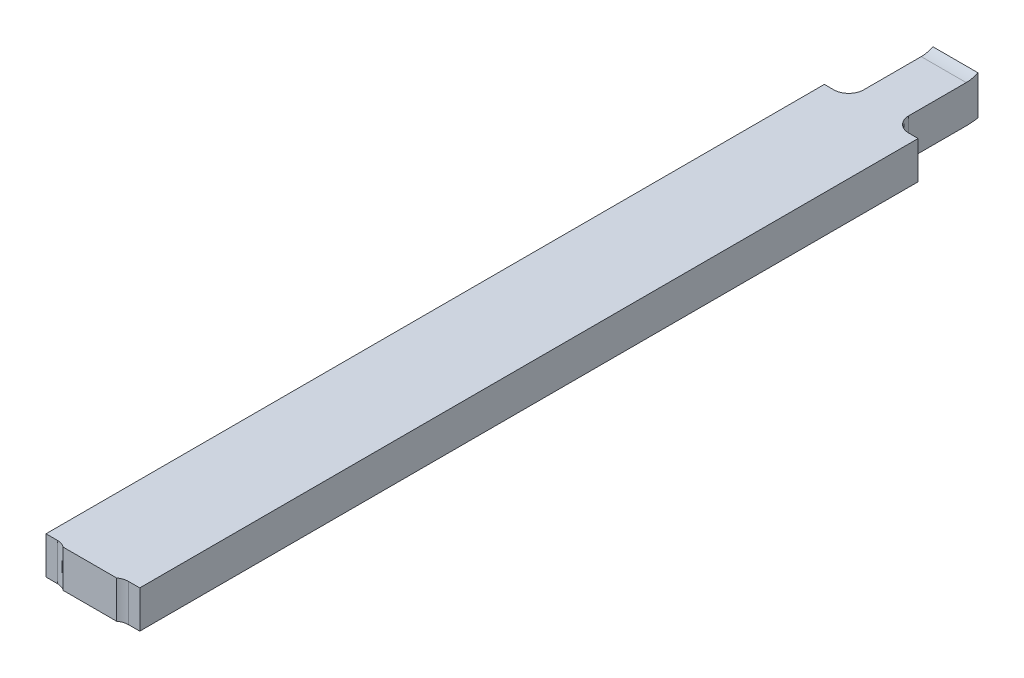
ISO-10303-21;
HEADER;
FILE_DESCRIPTION(('STEP AP214'),'2;1');
FILE_NAME('part.step','',(''),(''),'','','');
FILE_SCHEMA(('AUTOMOTIVE_DESIGN { 1 0 10303 214 1 1 1 1 }'));
ENDSEC;
DATA;
#1=APPLICATION_CONTEXT('core data for automotive mechanical design processes');
#2=APPLICATION_PROTOCOL_DEFINITION('international standard','automotive_design',2000,#1);
#3=PRODUCT_CONTEXT('',#1,'mechanical');
#4=PRODUCT('Part','Part','',(#3));
#5=PRODUCT_RELATED_PRODUCT_CATEGORY('part','',(#4));
#6=PRODUCT_DEFINITION_FORMATION('','',#4);
#7=PRODUCT_DEFINITION_CONTEXT('part definition',#1,'design');
#8=PRODUCT_DEFINITION('design','',#6,#7);
#9=PRODUCT_DEFINITION_SHAPE('','',#8);
#10=(LENGTH_UNIT() NAMED_UNIT(*) SI_UNIT(.MILLI.,.METRE.));
#11=(NAMED_UNIT(*) PLANE_ANGLE_UNIT() SI_UNIT($,.RADIAN.));
#12=(NAMED_UNIT(*) SI_UNIT($,.STERADIAN.) SOLID_ANGLE_UNIT());
#13=UNCERTAINTY_MEASURE_WITH_UNIT(LENGTH_MEASURE(1.E-05),#10,'distance_accuracy_value','');
#14=(GEOMETRIC_REPRESENTATION_CONTEXT(3) GLOBAL_UNCERTAINTY_ASSIGNED_CONTEXT((#13)) GLOBAL_UNIT_ASSIGNED_CONTEXT((#10,
#11,#12)) REPRESENTATION_CONTEXT('',''));
#15=CARTESIAN_POINT('',(0.,0.,0.));
#16=DIRECTION('',(0.,0.,1.));
#17=DIRECTION('',(1.,0.,0.));
#18=AXIS2_PLACEMENT_3D('',#15,#16,#17);
#19=CARTESIAN_POINT('',(4.,-0.3652289464185,-7.500488855463));
#20=DIRECTION('',(0.,0.,1.));
#21=DIRECTION('',(1.,0.,0.));
#22=AXIS2_PLACEMENT_3D('',#19,#20,#21);
#23=PLANE('',#22);
#24=DIRECTION('',(0.,1.,0.));
#25=VECTOR('',#24,1.);
#26=CARTESIAN_POINT('',(4.12,-0.3694122088881,-7.500488855463));
#27=LINE('',#26,#25);
#28=CARTESIAN_POINT('',(4.12,-0.469296338681694,-7.50048885546298));
#29=VERTEX_POINT('',#28);
#30=CARTESIAN_POINT('',(4.12,-0.261161554155171,-7.50048885546301));
#31=VERTEX_POINT('',#30);
#32=EDGE_CURVE('E150',#29,#31,#27,.T.);
#33=ORIENTED_EDGE('',*,*,#32,.F.);
#34=DIRECTION('',(-1.,0.,0.));
#35=VECTOR('',#34,1.);
#36=CARTESIAN_POINT('',(4.125727283719,-0.469296338681697,-7.50048885546296));
#37=LINE('',#36,#35);
#38=CARTESIAN_POINT('',(3.88,-0.469296338681694,-7.50048885546298));
#39=VERTEX_POINT('',#38);
#40=EDGE_CURVE('E139',#39,#29,#37,.F.);
#41=ORIENTED_EDGE('',*,*,#40,.F.);
#42=DIRECTION('',(0.,1.,0.));
#43=VECTOR('',#42,1.);
#44=CARTESIAN_POINT('',(3.88,-0.3694122088881,-7.500488855463));
#45=LINE('',#44,#43);
#46=CARTESIAN_POINT('',(3.88,-0.261161554155171,-7.50048885546301));
#47=VERTEX_POINT('',#46);
#48=EDGE_CURVE('E535',#39,#47,#45,.T.);
#49=ORIENTED_EDGE('',*,*,#48,.T.);
#50=DIRECTION('',(1.,0.,0.));
#51=VECTOR('',#50,1.);
#52=CARTESIAN_POINT('',(3.874272716281,-0.261161554155164,-7.50048885546303));
#53=LINE('',#52,#51);
#54=EDGE_CURVE('E147',#47,#31,#53,.T.);
#55=ORIENTED_EDGE('',*,*,#54,.T.);
#56=EDGE_LOOP('',(#33,#41,#49,#55));
#57=FACE_BOUND('',#56,.T.);
#58=ADVANCED_FACE('F17',(#57),#23,.F.);
#59=CARTESIAN_POINT('',(4.125727283719,-0.125,-7.43756007691));
#60=DIRECTION('',(-1.,0.,0.));
#61=DIRECTION('',(0.,0.,1.));
#62=AXIS2_PLACEMENT_3D('',#59,#60,#61);
#63=CYLINDRICAL_SURFACE('',#62,0.3499999999997);
#64=CARTESIAN_POINT('',(3.88,-0.125,-7.43756007691));
#65=DIRECTION('',(-1.,0.,0.));
#66=DIRECTION('',(0.,0.,1.));
#67=AXIS2_PLACEMENT_3D('',#64,#65,#66);
#68=CIRCLE('',#67,0.3499999999997);
#69=CARTESIAN_POINT('',(3.88,-0.475,-7.43756007691));
#70=VERTEX_POINT('',#69);
#71=EDGE_CURVE('E250',#70,#39,#68,.F.);
#72=ORIENTED_EDGE('',*,*,#71,.T.);
#73=ORIENTED_EDGE('',*,*,#40,.T.);
#74=CARTESIAN_POINT('',(4.12,-0.125,-7.43756007691));
#75=DIRECTION('',(-1.,0.,0.));
#76=DIRECTION('',(0.,0.,1.));
#77=AXIS2_PLACEMENT_3D('',#74,#75,#76);
#78=CIRCLE('',#77,0.3499999999997);
#79=CARTESIAN_POINT('',(4.12,-0.475,-7.43756007691));
#80=VERTEX_POINT('',#79);
#81=EDGE_CURVE('E274',#80,#29,#78,.F.);
#82=ORIENTED_EDGE('',*,*,#81,.F.);
#83=DIRECTION('',(1.,0.,0.));
#84=VECTOR('',#83,1.);
#85=CARTESIAN_POINT('',(4.,-0.475,-7.43756007691));
#86=LINE('',#85,#84);
#87=EDGE_CURVE('E138',#80,#70,#86,.F.);
#88=ORIENTED_EDGE('',*,*,#87,.T.);
#89=EDGE_LOOP('',(#72,#73,#82,#88));
#90=FACE_BOUND('',#89,.T.);
#91=ADVANCED_FACE('F255',(#90),#63,.T.);
#92=CARTESIAN_POINT('',(4.,-0.475,-5.160844573418));
#93=DIRECTION('',(0.,1.,0.));
#94=DIRECTION('',(0.,0.,1.));
#95=AXIS2_PLACEMENT_3D('',#92,#93,#94);
#96=PLANE('',#95);
#97=DIRECTION('',(1.,0.,0.));
#98=VECTOR('',#97,1.);
#99=CARTESIAN_POINT('',(4.,-0.475,-2.9));
#100=LINE('',#99,#98);
#101=CARTESIAN_POINT('',(3.75,-0.475,-2.9));
#102=VERTEX_POINT('',#101);
#103=CARTESIAN_POINT('',(3.81,-0.475,-2.89999999999976));
#104=VERTEX_POINT('',#103);
#105=EDGE_CURVE('E118',#102,#104,#100,.T.);
#106=ORIENTED_EDGE('',*,*,#105,.F.);
#107=DIRECTION('',(0.,0.,-1.));
#108=VECTOR('',#107,1.);
#109=CARTESIAN_POINT('',(3.75,-0.475,-4.975579331992));
#110=LINE('',#109,#108);
#111=CARTESIAN_POINT('',(3.75,-0.475,-7.051158663985));
#112=VERTEX_POINT('',#111);
#113=EDGE_CURVE('E213',#102,#112,#110,.T.);
#114=ORIENTED_EDGE('',*,*,#113,.T.);
#115=DIRECTION('',(1.,0.,0.));
#116=VECTOR('',#115,1.);
#117=CARTESIAN_POINT('',(3.775,-0.475,-7.051158663985));
#118=LINE('',#117,#116);
#119=CARTESIAN_POINT('',(3.8,-0.475,-7.05115866398505));
#120=VERTEX_POINT('',#119);
#121=EDGE_CURVE('E218',#112,#120,#118,.T.);
#122=ORIENTED_EDGE('',*,*,#121,.T.);
#123=CARTESIAN_POINT('',(3.88000000000032,-0.475,-7.131158663985));
#124=CARTESIAN_POINT('',(3.87999112440513,-0.475,-7.12663228539964));
#125=CARTESIAN_POINT('',(3.87960496952686,-0.475,-7.12211245444064));
#126=CARTESIAN_POINT('',(3.87808437325866,-0.475,-7.11320506981295));
#127=CARTESIAN_POINT('',(3.87695060689905,-0.475,-7.10881740054697));
#128=CARTESIAN_POINT('',(3.87244381446599,-0.475,-7.09604021502532));
#129=CARTESIAN_POINT('',(3.8679651813496,-0.475,-7.08801257629077));
#130=CARTESIAN_POINT('',(3.85665881135734,-0.475,-7.07397145931292));
#131=CARTESIAN_POINT('',(3.84985092513137,-0.475,-7.06794178198466));
#132=CARTESIAN_POINT('',(3.83457018431966,-0.475,-7.05845747919415));
#133=CARTESIAN_POINT('',(3.82608908375479,-0.475,-7.05501603051907));
#134=CARTESIAN_POINT('',(3.81161549132932,-0.475,-7.05178938735803));
#135=CARTESIAN_POINT('',(3.80580339960844,-0.475,-7.05114165155808));
#136=CARTESIAN_POINT('',(3.8,-0.475,-7.05115866398511));
#137=B_SPLINE_CURVE_WITH_KNOTS('',3,(#123,#124,#125,#126,#127,#128,#129,#130,#131,#132,#133,
#134,#135,#136),.UNSPECIFIED.,.F.,.F.,(4,2,2,2,2,2,4),(0.,0.0135512792184638,0.0270903394942115,
0.0541002294468885,0.0808854407469148,0.107806110463959,0.125207976056705),.UNSPECIFIED.);
#138=CARTESIAN_POINT('',(3.88000000000016,-0.475,-7.131158663985));
#139=VERTEX_POINT('',#138);
#140=EDGE_CURVE('E239',#139,#120,#137,.T.);
#141=ORIENTED_EDGE('',*,*,#140,.F.);
#142=DIRECTION('',(0.,0.,-1.));
#143=VECTOR('',#142,1.);
#144=CARTESIAN_POINT('',(3.88,-0.475,-7.317732357319));
#145=LINE('',#144,#143);
#146=EDGE_CURVE('E537',#139,#70,#145,.T.);
#147=ORIENTED_EDGE('',*,*,#146,.T.);
#148=ORIENTED_EDGE('',*,*,#87,.F.);
#149=DIRECTION('',(0.,0.,-1.));
#150=VECTOR('',#149,1.);
#151=CARTESIAN_POINT('',(4.12,-0.475,-7.317732357319));
#152=LINE('',#151,#150);
#153=CARTESIAN_POINT('',(4.12000000000005,-0.475,-7.131158663985));
#154=VERTEX_POINT('',#153);
#155=EDGE_CURVE('E533',#154,#80,#152,.T.);
#156=ORIENTED_EDGE('',*,*,#155,.F.);
#157=CARTESIAN_POINT('',(4.2,-0.475,-7.05115866398468));
#158=CARTESIAN_POINT('',(4.19547362141464,-0.475,-7.05116753957987));
#159=CARTESIAN_POINT('',(4.19095379045563,-0.475,-7.05155369445814));
#160=CARTESIAN_POINT('',(4.18204640582792,-0.475,-7.05307429072635));
#161=CARTESIAN_POINT('',(4.17765873656194,-0.475,-7.05420805708595));
#162=CARTESIAN_POINT('',(4.16488155104028,-0.475,-7.05871484951903));
#163=CARTESIAN_POINT('',(4.15685391230571,-0.475,-7.06319348263544));
#164=CARTESIAN_POINT('',(4.14281279532786,-0.475,-7.07449985262772));
#165=CARTESIAN_POINT('',(4.13678311799962,-0.475,-7.08130773885369));
#166=CARTESIAN_POINT('',(4.12729881520911,-0.475,-7.09658847966541));
#167=CARTESIAN_POINT('',(4.12385736653404,-0.475,-7.10506958023029));
#168=CARTESIAN_POINT('',(4.12063072337302,-0.475,-7.11954317265574));
#169=CARTESIAN_POINT('',(4.11998298757308,-0.475,-7.12535526437659));
#170=CARTESIAN_POINT('',(4.12000000000011,-0.475,-7.131158663985));
#171=B_SPLINE_CURVE_WITH_KNOTS('',3,(#157,#158,#159,#160,#161,#162,#163,#164,#165,#166,#167,
#168,#169,#170),.UNSPECIFIED.,.F.,.F.,(4,2,2,2,2,2,4),(0.,0.0135512792184821,0.0270903394942493,
0.0541002294469664,0.0808854407469868,0.107806110464046,0.125207976056707),.UNSPECIFIED.);
#172=CARTESIAN_POINT('',(4.2,-0.475,-7.05115866398484));
#173=VERTEX_POINT('',#172);
#174=EDGE_CURVE('E266',#173,#154,#171,.T.);
#175=ORIENTED_EDGE('',*,*,#174,.F.);
#176=DIRECTION('',(1.,0.,0.));
#177=VECTOR('',#176,1.);
#178=CARTESIAN_POINT('',(4.225,-0.475,-7.051158663985));
#179=LINE('',#178,#177);
#180=CARTESIAN_POINT('',(4.25,-0.475,-7.051158663985));
#181=VERTEX_POINT('',#180);
#182=EDGE_CURVE('E151',#173,#181,#179,.T.);
#183=ORIENTED_EDGE('',*,*,#182,.T.);
#184=DIRECTION('',(0.,0.,-1.));
#185=VECTOR('',#184,1.);
#186=CARTESIAN_POINT('',(4.25,-0.475,-4.975579331992));
#187=LINE('',#186,#185);
#188=CARTESIAN_POINT('',(4.25,-0.475,-2.9));
#189=VERTEX_POINT('',#188);
#190=EDGE_CURVE('E155',#189,#181,#187,.T.);
#191=ORIENTED_EDGE('',*,*,#190,.F.);
#192=DIRECTION('',(1.,0.,0.));
#193=VECTOR('',#192,1.);
#194=CARTESIAN_POINT('',(4.22,-0.475,-2.9));
#195=LINE('',#194,#193);
#196=CARTESIAN_POINT('',(4.19,-0.475,-2.89999999999989));
#197=VERTEX_POINT('',#196);
#198=EDGE_CURVE('E163',#197,#189,#195,.T.);
#199=ORIENTED_EDGE('',*,*,#198,.F.);
#200=CARTESIAN_POINT('',(4.14217544757885,-0.475,-2.8841290699251));
#201=CARTESIAN_POINT('',(4.14622022070471,-0.475,-2.88715347788678));
#202=CARTESIAN_POINT('',(4.1505544258207,-0.475,-2.88978498732686));
#203=CARTESIAN_POINT('',(4.15913369497632,-0.475,-2.8939430866676));
#204=CARTESIAN_POINT('',(4.16333518410899,-0.475,-2.89555994023161));
#205=CARTESIAN_POINT('',(4.17194880942199,-0.475,-2.89806057790455));
#206=CARTESIAN_POINT('',(4.17636081104944,-0.475,-2.89894482380699));
#207=CARTESIAN_POINT('',(4.18386363483119,-0.475,-2.89981357444961));
#208=CARTESIAN_POINT('',(4.18693284156798,-0.475,-2.89999375978714));
#209=CARTESIAN_POINT('',(4.19,-0.475,-2.89999999999978));
#210=B_SPLINE_CURVE_WITH_KNOTS('',3,(#200,#201,#202,#203,#204,#205,#206,#207,#208,#209),
.UNSPECIFIED.,.F.,.F.,(4,2,2,2,4),(0.,0.0151223248428411,0.0285648972663083,0.0419989898086751,
0.0512012871013987),.UNSPECIFIED.);
#211=CARTESIAN_POINT('',(4.14217544757892,-0.475,-2.88412906992505));
#212=VERTEX_POINT('',#211);
#213=EDGE_CURVE('E125',#212,#197,#210,.T.);
#214=ORIENTED_EDGE('',*,*,#213,.F.);
#215=DIRECTION('',(1.,0.,0.));
#216=VECTOR('',#215,1.);
#217=CARTESIAN_POINT('',(4.,-0.475,-2.884129069925));
#218=LINE('',#217,#216);
#219=CARTESIAN_POINT('',(3.85782456637205,-0.475,-2.88412906992502));
#220=VERTEX_POINT('',#219);
#221=EDGE_CURVE('E129',#220,#212,#218,.T.);
#222=ORIENTED_EDGE('',*,*,#221,.F.);
#223=CARTESIAN_POINT('',(3.81,-0.475,-2.89999999999952));
#224=CARTESIAN_POINT('',(3.81503269638164,-0.475,-2.90001482409384));
#225=CARTESIAN_POINT('',(3.82008184216692,-0.475,-2.89952557596737));
#226=CARTESIAN_POINT('',(3.83385228395106,-0.475,-2.89686256447201));
#227=CARTESIAN_POINT('',(3.84239947608123,-0.475,-2.89367998586962));
#228=CARTESIAN_POINT('',(3.85280786570126,-0.475,-2.88765952253235));
#229=CARTESIAN_POINT('',(3.85537440128387,-0.475,-2.88596721904186));
#230=CARTESIAN_POINT('',(3.8578245663721,-0.475,-2.88412906992503));
#231=B_SPLINE_CURVE_WITH_KNOTS('',3,(#223,#224,#225,#226,#227,#228,#229,#230),.UNSPECIFIED.,.F.,
.F.,(4,2,2,4),(0.,0.0151178951010511,0.0419060489799024,0.0511063402020691),.UNSPECIFIED.);
#232=EDGE_CURVE('E20',#104,#220,#231,.T.);
#233=ORIENTED_EDGE('',*,*,#232,.F.);
#234=EDGE_LOOP('',(#106,#114,#122,#141,#147,#148,#156,#175,#183,#191,#199,#214,#222,#233));
#235=FACE_BOUND('',#234,.T.);
#236=ADVANCED_FACE('F135',(#235),#96,.F.);
#237=CARTESIAN_POINT('',(4.192867608479,-0.269272716281,-2.899957930186));
#238=CARTESIAN_POINT('',(4.191912675517,-0.269272716281,-2.899988554812));
#239=CARTESIAN_POINT('',(4.185731487658,-0.269272716281,-2.900079343105));
#240=CARTESIAN_POINT('',(4.174291413689,-0.269272716281,-2.898963559635));
#241=CARTESIAN_POINT('',(4.159190917084,-0.269272716281,-2.894390814224));
#242=CARTESIAN_POINT('',(4.1486873263,-0.269272716281,-2.888776760997));
#243=CARTESIAN_POINT('',(4.141721023167,-0.269272716281,-2.883851645707));
#244=CARTESIAN_POINT('',(4.139152051861,-0.269272716281,-2.881786274905));
#245=CARTESIAN_POINT('',(4.137705478113,-0.269272716281,-2.880535760884));
#246=(BOUNDED_CURVE() B_SPLINE_CURVE(3,(#237,#238,#239,#240,#241,#242,#243,#244,#245),
.UNSPECIFIED.,.F.,.F.) B_SPLINE_CURVE_WITH_KNOTS((4,1,1,1,1,1,4),(0.,0.0480076126077,
0.3103664664067,0.5726487803877,0.8349383013298,0.9041878403074,1.),
.UNSPECIFIED.) CURVE() GEOMETRIC_REPRESENTATION_ITEM() RATIONAL_B_SPLINE_CURVE((1.,1.,1.,1.,1.,
1.,1.,1.,1.)) REPRESENTATION_ITEM(''));
#247=DIRECTION('',(0.,-1.,0.));
#248=VECTOR('',#247,1.);
#249=SURFACE_OF_LINEAR_EXTRUSION('',#246,#248);
#250=CARTESIAN_POINT('',(4.14217544464746,-0.275,-2.88412906773656));
#251=CARTESIAN_POINT('',(4.14622021763433,-0.275,-2.88715347588347));
#252=CARTESIAN_POINT('',(4.15055442262976,-0.275,-2.88978498552233));
#253=CARTESIAN_POINT('',(4.15913369159402,-0.275,-2.89394308525624));
#254=CARTESIAN_POINT('',(4.16333518065168,-0.275,-2.89555993901277));
#255=CARTESIAN_POINT('',(4.17194880584974,-0.275,-2.89806057708111));
#256=CARTESIAN_POINT('',(4.17636080743733,-0.275,-2.89894482318606));
#257=CARTESIAN_POINT('',(4.18386363239327,-0.275,-2.89981357430863));
#258=CARTESIAN_POINT('',(4.18693284034916,-0.275,-2.89999375978684));
#259=CARTESIAN_POINT('',(4.19,-0.275,-2.89999999999978));
#260=B_SPLINE_CURVE_WITH_KNOTS('',3,(#250,#251,#252,#253,#254,#255,#256,#257,#258,#259),
.UNSPECIFIED.,.F.,.F.,(4,2,2,2,4),(0.,0.015122324842671,0.0285648972632462,0.041998989809666,
0.0512012907536541),.UNSPECIFIED.);
#261=CARTESIAN_POINT('',(4.14217544611323,-0.275,-2.88412906883078));
#262=VERTEX_POINT('',#261);
#263=CARTESIAN_POINT('',(4.19,-0.275,-2.9));
#264=VERTEX_POINT('',#263);
#265=EDGE_CURVE('E132',#262,#264,#260,.T.);
#266=ORIENTED_EDGE('',*,*,#265,.F.);
#267=DIRECTION('',(0.,1.,0.));
#268=VECTOR('',#267,1.);
#269=CARTESIAN_POINT('',(4.142175447579,-0.375,-2.884129069925));
#270=LINE('',#269,#268);
#271=EDGE_CURVE('E133',#212,#262,#270,.T.);
#272=ORIENTED_EDGE('',*,*,#271,.F.);
#273=ORIENTED_EDGE('',*,*,#213,.T.);
#274=DIRECTION('',(0.,1.,0.));
#275=VECTOR('',#274,1.);
#276=CARTESIAN_POINT('',(4.19,-0.375,-2.9));
#277=LINE('',#276,#275);
#278=EDGE_CURVE('E166',#264,#197,#277,.F.);
#279=ORIENTED_EDGE('',*,*,#278,.F.);
#280=EDGE_LOOP('',(#266,#272,#273,#279));
#281=FACE_BOUND('',#280,.T.);
#282=ADVANCED_FACE('F254',(#281),#249,.T.);
#283=CARTESIAN_POINT('',(4.22,-0.375,-2.9));
#284=DIRECTION('',(0.,0.,1.));
#285=DIRECTION('',(1.,0.,0.));
#286=AXIS2_PLACEMENT_3D('',#283,#284,#285);
#287=PLANE('',#286);
#288=DIRECTION('',(0.,1.,0.));
#289=VECTOR('',#288,1.);
#290=CARTESIAN_POINT('',(4.25,-0.375,-2.9));
#291=LINE('',#290,#289);
#292=CARTESIAN_POINT('',(4.25,-0.275,-2.9));
#293=VERTEX_POINT('',#292);
#294=EDGE_CURVE('E160',#293,#189,#291,.F.);
#295=ORIENTED_EDGE('',*,*,#294,.F.);
#296=DIRECTION('',(1.,0.,0.));
#297=VECTOR('',#296,1.);
#298=CARTESIAN_POINT('',(4.,-0.275,-2.9));
#299=LINE('',#298,#297);
#300=EDGE_CURVE('E306',#264,#293,#299,.T.);
#301=ORIENTED_EDGE('',*,*,#300,.F.);
#302=ORIENTED_EDGE('',*,*,#278,.T.);
#303=ORIENTED_EDGE('',*,*,#198,.T.);
#304=EDGE_LOOP('',(#295,#301,#302,#303));
#305=FACE_BOUND('',#304,.T.);
#306=ADVANCED_FACE('F368',(#305),#287,.T.);
#307=CARTESIAN_POINT('',(4.25,-0.375,-4.975579331992));
#308=DIRECTION('',(1.,0.,0.));
#309=DIRECTION('',(0.,0.,-1.));
#310=AXIS2_PLACEMENT_3D('',#307,#308,#309);
#311=PLANE('',#310);
#312=DIRECTION('',(0.,1.,0.));
#313=VECTOR('',#312,1.);
#314=CARTESIAN_POINT('',(4.25,-0.375,-7.051158663985));
#315=LINE('',#314,#313);
#316=CARTESIAN_POINT('',(4.25,-0.275,-7.051158663985));
#317=VERTEX_POINT('',#316);
#318=EDGE_CURVE('E154',#181,#317,#315,.T.);
#319=ORIENTED_EDGE('',*,*,#318,.T.);
#320=DIRECTION('',(0.,0.,1.));
#321=VECTOR('',#320,1.);
#322=CARTESIAN_POINT('',(4.25,-0.275,-5.160844573418));
#323=LINE('',#322,#321);
#324=EDGE_CURVE('E302',#293,#317,#323,.F.);
#325=ORIENTED_EDGE('',*,*,#324,.F.);
#326=ORIENTED_EDGE('',*,*,#294,.T.);
#327=ORIENTED_EDGE('',*,*,#190,.T.);
#328=EDGE_LOOP('',(#319,#325,#326,#327));
#329=FACE_BOUND('',#328,.T.);
#330=ADVANCED_FACE('F373',(#329),#311,.T.);
#331=CARTESIAN_POINT('',(4.225,-0.375,-7.051158663985));
#332=DIRECTION('',(0.,0.,1.));
#333=DIRECTION('',(1.,0.,0.));
#334=AXIS2_PLACEMENT_3D('',#331,#332,#333);
#335=PLANE('',#334);
#336=ORIENTED_EDGE('',*,*,#182,.F.);
#337=DIRECTION('',(0.,-1.,0.));
#338=VECTOR('',#337,1.);
#339=CARTESIAN_POINT('',(4.2,-0.269272716281,-7.05115866398468));
#340=LINE('',#339,#338);
#341=CARTESIAN_POINT('',(4.2,-0.275,-7.05115866398476));
#342=VERTEX_POINT('',#341);
#343=EDGE_CURVE('E273',#342,#173,#340,.T.);
#344=ORIENTED_EDGE('',*,*,#343,.F.);
#345=DIRECTION('',(1.,0.,0.));
#346=VECTOR('',#345,1.);
#347=CARTESIAN_POINT('',(4.,-0.275,-7.051158663985));
#348=LINE('',#347,#346);
#349=EDGE_CURVE('E305',#317,#342,#348,.F.);
#350=ORIENTED_EDGE('',*,*,#349,.F.);
#351=ORIENTED_EDGE('',*,*,#318,.F.);
#352=EDGE_LOOP('',(#336,#344,#350,#351));
#353=FACE_BOUND('',#352,.T.);
#354=ADVANCED_FACE('F283',(#353),#335,.F.);
#355=CARTESIAN_POINT('',(4.120042070413,-0.269272716281,-7.134026291144));
#356=CARTESIAN_POINT('',(4.120011445371,-0.269272716281,-7.133071351971));
#357=CARTESIAN_POINT('',(4.119920656285,-0.269272716281,-7.126890157897));
#358=CARTESIAN_POINT('',(4.121036440365,-0.269272716281,-7.115450077674));
#359=CARTESIAN_POINT('',(4.125609185776,-0.269272716281,-7.100349581069));
#360=CARTESIAN_POINT('',(4.133048947975,-0.269272716281,-7.086430187272));
#361=CARTESIAN_POINT('',(4.143068695624,-0.269272716281,-7.074236320435));
#362=CARTESIAN_POINT('',(4.155262096496,-0.269272716281,-7.064213675467));
#363=CARTESIAN_POINT('',(4.169183798376,-0.269272716281,-7.056770327068));
#364=CARTESIAN_POINT('',(4.184287959508,-0.269272716281,-7.05219575577));
#365=CARTESIAN_POINT('',(4.195729514596,-0.269272716281,-7.051079350384));
#366=CARTESIAN_POINT('',(4.201910679261,-0.269272716281,-7.051170096432));
#367=CARTESIAN_POINT('',(4.202864618741,-0.269272716281,-7.0512006723));
#368=(BOUNDED_CURVE() B_SPLINE_CURVE(3,(#355,#356,#357,#358,#359,#360,#361,#362,#363,#364,#365,
#366,#367),.UNSPECIFIED.,.F.,.F.) B_SPLINE_CURVE_WITH_KNOTS((4,1,1,1,1,1,1,1,1,1,4),(0.,
0.02187366901522,0.1414112381412,0.260913933719,0.380419912977,0.4999590271853,0.6195124003892,
0.7390518477007,0.8585895788734,0.9781493142558,1.),
.UNSPECIFIED.) CURVE() GEOMETRIC_REPRESENTATION_ITEM() RATIONAL_B_SPLINE_CURVE((1.,1.,1.,1.,1.,
1.,1.,1.,1.,1.,1.,1.,1.)) REPRESENTATION_ITEM(''));
#369=DIRECTION('',(0.,-1.,0.));
#370=VECTOR('',#369,1.);
#371=SURFACE_OF_LINEAR_EXTRUSION('',#368,#370);
#372=DIRECTION('',(0.,1.,0.));
#373=VECTOR('',#372,1.);
#374=CARTESIAN_POINT('',(4.12,-0.3694122088881,-7.131158663985));
#375=LINE('',#374,#373);
#376=CARTESIAN_POINT('',(4.12,-0.275,-7.131158663985));
#377=VERTEX_POINT('',#376);
#378=EDGE_CURVE('E272',#377,#154,#375,.F.);
#379=ORIENTED_EDGE('',*,*,#378,.F.);
#380=CARTESIAN_POINT('',(4.2,-0.275,-7.05115866398468));
#381=CARTESIAN_POINT('',(4.19547362141464,-0.275,-7.05116753957987));
#382=CARTESIAN_POINT('',(4.19095379045563,-0.275,-7.05155369445814));
#383=CARTESIAN_POINT('',(4.18204640582792,-0.275,-7.05307429072635));
#384=CARTESIAN_POINT('',(4.17765873656194,-0.275,-7.05420805708595));
#385=CARTESIAN_POINT('',(4.16488155104028,-0.275,-7.05871484951903));
#386=CARTESIAN_POINT('',(4.15685391230571,-0.275,-7.06319348263544));
#387=CARTESIAN_POINT('',(4.14281279532786,-0.275,-7.07449985262772));
#388=CARTESIAN_POINT('',(4.13678311799962,-0.275,-7.08130773885369));
#389=CARTESIAN_POINT('',(4.12729881520911,-0.275,-7.09658847966541));
#390=CARTESIAN_POINT('',(4.12385736653404,-0.275,-7.10506958023029));
#391=CARTESIAN_POINT('',(4.12063072337302,-0.275,-7.11954317265574));
#392=CARTESIAN_POINT('',(4.11998298757308,-0.275,-7.12535526437659));
#393=CARTESIAN_POINT('',(4.12000000000011,-0.275,-7.131158663985));
#394=B_SPLINE_CURVE_WITH_KNOTS('',3,(#380,#381,#382,#383,#384,#385,#386,#387,#388,#389,#390,
#391,#392,#393),.UNSPECIFIED.,.F.,.F.,(4,2,2,2,2,2,4),(0.,0.0135512792184821,0.0270903394942493,
0.0541002294469664,0.0808854407469868,0.107806110464046,0.125207976056707),.UNSPECIFIED.);
#395=EDGE_CURVE('E355',#342,#377,#394,.T.);
#396=ORIENTED_EDGE('',*,*,#395,.F.);
#397=ORIENTED_EDGE('',*,*,#343,.T.);
#398=ORIENTED_EDGE('',*,*,#174,.T.);
#399=EDGE_LOOP('',(#379,#396,#397,#398));
#400=FACE_BOUND('',#399,.T.);
#401=ADVANCED_FACE('F276',(#400),#371,.T.);
#402=CARTESIAN_POINT('',(4.12,-0.3694122088881,-7.317732357319));
#403=DIRECTION('',(1.,0.,0.));
#404=DIRECTION('',(0.,0.,-1.));
#405=AXIS2_PLACEMENT_3D('',#402,#403,#404);
#406=PLANE('',#405);
#407=ORIENTED_EDGE('',*,*,#81,.T.);
#408=ORIENTED_EDGE('',*,*,#32,.T.);
#409=CARTESIAN_POINT('',(4.12,-0.125,-7.437560076911));
#410=DIRECTION('',(1.,0.,0.));
#411=DIRECTION('',(0.,0.,-1.));
#412=AXIS2_PLACEMENT_3D('',#409,#410,#411);
#413=CIRCLE('',#412,0.15);
#414=CARTESIAN_POINT('',(4.12,-0.275,-7.437560076911));
#415=VERTEX_POINT('',#414);
#416=EDGE_CURVE('E149',#31,#415,#413,.F.);
#417=ORIENTED_EDGE('',*,*,#416,.T.);
#418=DIRECTION('',(0.,0.,1.));
#419=VECTOR('',#418,1.);
#420=CARTESIAN_POINT('',(4.12,-0.275,-5.160844573418));
#421=LINE('',#420,#419);
#422=EDGE_CURVE('E348',#377,#415,#421,.F.);
#423=ORIENTED_EDGE('',*,*,#422,.F.);
#424=ORIENTED_EDGE('',*,*,#378,.T.);
#425=ORIENTED_EDGE('',*,*,#155,.T.);
#426=EDGE_LOOP('',(#407,#408,#417,#423,#424,#425));
#427=FACE_BOUND('',#426,.T.);
#428=ADVANCED_FACE('F282',(#427),#406,.T.);
#429=CARTESIAN_POINT('',(3.874272716281,-0.125,-7.437560076911));
#430=DIRECTION('',(1.,0.,0.));
#431=DIRECTION('',(0.,0.,-1.));
#432=AXIS2_PLACEMENT_3D('',#429,#430,#431);
#433=CYLINDRICAL_SURFACE('',#432,0.15);
#434=DIRECTION('',(1.,0.,0.));
#435=VECTOR('',#434,1.);
#436=CARTESIAN_POINT('',(4.,-0.275,-7.437560076911));
#437=LINE('',#436,#435);
#438=CARTESIAN_POINT('',(3.88,-0.275,-7.437560076911));
#439=VERTEX_POINT('',#438);
#440=EDGE_CURVE('E346',#415,#439,#437,.F.);
#441=ORIENTED_EDGE('',*,*,#440,.F.);
#442=ORIENTED_EDGE('',*,*,#416,.F.);
#443=ORIENTED_EDGE('',*,*,#54,.F.);
#444=CARTESIAN_POINT('',(3.88,-0.125,-7.437560076911));
#445=DIRECTION('',(1.,0.,0.));
#446=DIRECTION('',(0.,0.,-1.));
#447=AXIS2_PLACEMENT_3D('',#444,#445,#446);
#448=CIRCLE('',#447,0.15);
#449=EDGE_CURVE('E536',#47,#439,#448,.F.);
#450=ORIENTED_EDGE('',*,*,#449,.T.);
#451=EDGE_LOOP('',(#441,#442,#443,#450));
#452=FACE_BOUND('',#451,.T.);
#453=ADVANCED_FACE('F443',(#452),#433,.F.);
#454=CARTESIAN_POINT('',(3.88,-0.3694122088881,-7.317732357319));
#455=DIRECTION('',(1.,0.,0.));
#456=DIRECTION('',(0.,0.,-1.));
#457=AXIS2_PLACEMENT_3D('',#454,#455,#456);
#458=PLANE('',#457);
#459=ORIENTED_EDGE('',*,*,#146,.F.);
#460=DIRECTION('',(0.,-1.,0.));
#461=VECTOR('',#460,1.);
#462=CARTESIAN_POINT('',(3.88000000000032,-0.269272716281,-7.131158663985));
#463=LINE('',#462,#461);
#464=CARTESIAN_POINT('',(3.88000000000024,-0.275,-7.131158663985));
#465=VERTEX_POINT('',#464);
#466=EDGE_CURVE('E223',#465,#139,#463,.T.);
#467=ORIENTED_EDGE('',*,*,#466,.F.);
#468=DIRECTION('',(0.,0.,1.));
#469=VECTOR('',#468,1.);
#470=CARTESIAN_POINT('',(3.88,-0.275,-5.160844573418));
#471=LINE('',#470,#469);
#472=EDGE_CURVE('E345',#439,#465,#471,.T.);
#473=ORIENTED_EDGE('',*,*,#472,.F.);
#474=ORIENTED_EDGE('',*,*,#449,.F.);
#475=ORIENTED_EDGE('',*,*,#48,.F.);
#476=ORIENTED_EDGE('',*,*,#71,.F.);
#477=EDGE_LOOP('',(#459,#467,#473,#474,#475,#476));
#478=FACE_BOUND('',#477,.T.);
#479=ADVANCED_FACE('F234',(#478),#458,.F.);
#480=CARTESIAN_POINT('',(3.797132372841,-0.269272716281,-7.051200734398));
#481=CARTESIAN_POINT('',(3.798087312014,-0.269272716281,-7.051170109356));
#482=CARTESIAN_POINT('',(3.804268506088,-0.269272716281,-7.05107932027));
#483=CARTESIAN_POINT('',(3.815708586311,-0.269272716281,-7.05219510435));
#484=CARTESIAN_POINT('',(3.830809082916,-0.269272716281,-7.056767849761));
#485=CARTESIAN_POINT('',(3.844728476713,-0.269272716281,-7.06420761196));
#486=CARTESIAN_POINT('',(3.85692234355,-0.269272716281,-7.074227359609));
#487=CARTESIAN_POINT('',(3.866944988518,-0.269272716281,-7.086420760481));
#488=CARTESIAN_POINT('',(3.874388336917,-0.269272716281,-7.100342462361));
#489=CARTESIAN_POINT('',(3.878962908215,-0.269272716281,-7.115446623493));
#490=CARTESIAN_POINT('',(3.880079313601,-0.269272716281,-7.126888178581));
#491=CARTESIAN_POINT('',(3.879988567553,-0.269272716281,-7.133069343246));
#492=CARTESIAN_POINT('',(3.879957991685,-0.269272716281,-7.134023282726));
#493=(BOUNDED_CURVE() B_SPLINE_CURVE(3,(#480,#481,#482,#483,#484,#485,#486,#487,#488,#489,#490,
#491,#492),.UNSPECIFIED.,.F.,.F.) B_SPLINE_CURVE_WITH_KNOTS((4,1,1,1,1,1,1,1,1,1,4),(0.,
0.02187366901522,0.1414112381413,0.260913933719,0.380419912977,0.4999590271853,0.6195124003892,
0.7390518477007,0.8585895788734,0.9781493142558,1.),
.UNSPECIFIED.) CURVE() GEOMETRIC_REPRESENTATION_ITEM() RATIONAL_B_SPLINE_CURVE((1.,1.,1.,1.,1.,
1.,1.,1.,1.,1.,1.,1.,1.)) REPRESENTATION_ITEM(''));
#494=DIRECTION('',(0.,-1.,0.));
#495=VECTOR('',#494,1.);
#496=SURFACE_OF_LINEAR_EXTRUSION('',#493,#495);
#497=DIRECTION('',(0.,1.,0.));
#498=VECTOR('',#497,1.);
#499=CARTESIAN_POINT('',(3.8,-0.375,-7.051158663985));
#500=LINE('',#499,#498);
#501=CARTESIAN_POINT('',(3.8,-0.275,-7.051158663985));
#502=VERTEX_POINT('',#501);
#503=EDGE_CURVE('E216',#120,#502,#500,.T.);
#504=ORIENTED_EDGE('',*,*,#503,.T.);
#505=CARTESIAN_POINT('',(3.88000000000032,-0.275,-7.131158663985));
#506=CARTESIAN_POINT('',(3.87999112440513,-0.275,-7.12663228539964));
#507=CARTESIAN_POINT('',(3.87960496952686,-0.275,-7.12211245444064));
#508=CARTESIAN_POINT('',(3.87808437325866,-0.275,-7.11320506981295));
#509=CARTESIAN_POINT('',(3.87695060689905,-0.275,-7.10881740054697));
#510=CARTESIAN_POINT('',(3.87244381446599,-0.275,-7.09604021502532));
#511=CARTESIAN_POINT('',(3.8679651813496,-0.275,-7.08801257629077));
#512=CARTESIAN_POINT('',(3.85665881135734,-0.275,-7.07397145931292));
#513=CARTESIAN_POINT('',(3.84985092513137,-0.275,-7.06794178198466));
#514=CARTESIAN_POINT('',(3.83457018431966,-0.275,-7.05845747919415));
#515=CARTESIAN_POINT('',(3.82608908375479,-0.275,-7.05501603051907));
#516=CARTESIAN_POINT('',(3.81161549132932,-0.275,-7.05178938735803));
#517=CARTESIAN_POINT('',(3.80580339960844,-0.275,-7.05114165155807));
#518=CARTESIAN_POINT('',(3.8,-0.275,-7.05115866398511));
#519=B_SPLINE_CURVE_WITH_KNOTS('',3,(#505,#506,#507,#508,#509,#510,#511,#512,#513,#514,#515,
#516,#517,#518),.UNSPECIFIED.,.F.,.F.,(4,2,2,2,2,2,4),(0.,0.0135512792184638,0.0270903394942115,
0.0541002294468885,0.0808854407469148,0.107806110463959,0.125207976056707),.UNSPECIFIED.);
#520=EDGE_CURVE('E175',#465,#502,#519,.T.);
#521=ORIENTED_EDGE('',*,*,#520,.F.);
#522=ORIENTED_EDGE('',*,*,#466,.T.);
#523=ORIENTED_EDGE('',*,*,#140,.T.);
#524=EDGE_LOOP('',(#504,#521,#522,#523));
#525=FACE_BOUND('',#524,.T.);
#526=ADVANCED_FACE('F228',(#525),#496,.T.);
#527=CARTESIAN_POINT('',(3.775,-0.375,-7.051158663985));
#528=DIRECTION('',(0.,0.,1.));
#529=DIRECTION('',(1.,0.,0.));
#530=AXIS2_PLACEMENT_3D('',#527,#528,#529);
#531=PLANE('',#530);
#532=ORIENTED_EDGE('',*,*,#121,.F.);
#533=DIRECTION('',(0.,1.,0.));
#534=VECTOR('',#533,1.);
#535=CARTESIAN_POINT('',(3.75,-0.375,-7.051158663985));
#536=LINE('',#535,#534);
#537=CARTESIAN_POINT('',(3.75,-0.275,-7.051158663985));
#538=VERTEX_POINT('',#537);
#539=EDGE_CURVE('E202',#112,#538,#536,.T.);
#540=ORIENTED_EDGE('',*,*,#539,.T.);
#541=DIRECTION('',(1.,0.,0.));
#542=VECTOR('',#541,1.);
#543=CARTESIAN_POINT('',(4.,-0.275,-7.051158663985));
#544=LINE('',#543,#542);
#545=EDGE_CURVE('E208',#502,#538,#544,.F.);
#546=ORIENTED_EDGE('',*,*,#545,.F.);
#547=ORIENTED_EDGE('',*,*,#503,.F.);
#548=EDGE_LOOP('',(#532,#540,#546,#547));
#549=FACE_BOUND('',#548,.T.);
#550=ADVANCED_FACE('F233',(#549),#531,.F.);
#551=CARTESIAN_POINT('',(3.75,-0.375,-4.975579331992));
#552=DIRECTION('',(1.,0.,0.));
#553=DIRECTION('',(0.,0.,-1.));
#554=AXIS2_PLACEMENT_3D('',#551,#552,#553);
#555=PLANE('',#554);
#556=ORIENTED_EDGE('',*,*,#113,.F.);
#557=DIRECTION('',(0.,1.,0.));
#558=VECTOR('',#557,1.);
#559=CARTESIAN_POINT('',(3.75,-0.375,-2.9));
#560=LINE('',#559,#558);
#561=CARTESIAN_POINT('',(3.75,-0.275,-2.9));
#562=VERTEX_POINT('',#561);
#563=EDGE_CURVE('E200',#562,#102,#560,.F.);
#564=ORIENTED_EDGE('',*,*,#563,.F.);
#565=DIRECTION('',(0.,0.,1.));
#566=VECTOR('',#565,1.);
#567=CARTESIAN_POINT('',(3.75,-0.275,-5.160844573418));
#568=LINE('',#567,#566);
#569=EDGE_CURVE('E205',#538,#562,#568,.T.);
#570=ORIENTED_EDGE('',*,*,#569,.F.);
#571=ORIENTED_EDGE('',*,*,#539,.F.);
#572=EDGE_LOOP('',(#556,#564,#570,#571));
#573=FACE_BOUND('',#572,.T.);
#574=ADVANCED_FACE('F384',(#573),#555,.F.);
#575=CARTESIAN_POINT('',(3.78,-0.375,-2.9));
#576=DIRECTION('',(0.,0.,1.));
#577=DIRECTION('',(1.,0.,0.));
#578=AXIS2_PLACEMENT_3D('',#575,#576,#577);
#579=PLANE('',#578);
#580=DIRECTION('',(0.,-1.,0.));
#581=VECTOR('',#580,1.);
#582=CARTESIAN_POINT('',(3.81,-0.269272716281,-2.89999999999952));
#583=LINE('',#582,#581);
#584=CARTESIAN_POINT('',(3.81,-0.275,-2.89999999999964));
#585=VERTEX_POINT('',#584);
#586=EDGE_CURVE('E122',#585,#104,#583,.T.);
#587=ORIENTED_EDGE('',*,*,#586,.F.);
#588=DIRECTION('',(1.,0.,0.));
#589=VECTOR('',#588,1.);
#590=CARTESIAN_POINT('',(4.,-0.275,-2.9));
#591=LINE('',#590,#589);
#592=EDGE_CURVE('E174',#562,#585,#591,.T.);
#593=ORIENTED_EDGE('',*,*,#592,.F.);
#594=ORIENTED_EDGE('',*,*,#563,.T.);
#595=ORIENTED_EDGE('',*,*,#105,.T.);
#596=EDGE_LOOP('',(#587,#593,#594,#595));
#597=FACE_BOUND('',#596,.T.);
#598=ADVANCED_FACE('F188',(#597),#579,.T.);
#599=CARTESIAN_POINT('',(3.862294531819,-0.269272716281,-2.880535754175));
#600=CARTESIAN_POINT('',(3.860847959215,-0.269272716281,-2.881786269205));
#601=CARTESIAN_POINT('',(3.858282097423,-0.269272716281,-2.88384914542));
#602=CARTESIAN_POINT('',(3.851318238129,-0.269272716281,-2.888773339751));
#603=CARTESIAN_POINT('',(3.840816201624,-0.269272716281,-2.894388336917));
#604=CARTESIAN_POINT('',(3.825712040492,-0.269272716281,-2.898962908215));
#605=CARTESIAN_POINT('',(3.814270490801,-0.269272716281,-2.900079313074));
#606=CARTESIAN_POINT('',(3.808089331501,-0.269272716281,-2.89998856771));
#607=CARTESIAN_POINT('',(3.807135397382,-0.269272716281,-2.899957992201));
#608=(BOUNDED_CURVE() B_SPLINE_CURVE(3,(#599,#600,#601,#602,#603,#604,#605,#606,#607),
.UNSPECIFIED.,.F.,.F.) B_SPLINE_CURVE_WITH_KNOTS((4,1,1,1,1,1,4),(0.,0.09581704921695,
0.1648704820857,0.4272468470588,0.6896194452896,0.952040340422,1.),
.UNSPECIFIED.) CURVE() GEOMETRIC_REPRESENTATION_ITEM() RATIONAL_B_SPLINE_CURVE((1.,1.,1.,1.,1.,
1.,1.,1.,1.)) REPRESENTATION_ITEM(''));
#609=DIRECTION('',(0.,-1.,0.));
#610=VECTOR('',#609,1.);
#611=SURFACE_OF_LINEAR_EXTRUSION('',#608,#610);
#612=ORIENTED_EDGE('',*,*,#232,.T.);
#613=DIRECTION('',(0.,1.,0.));
#614=VECTOR('',#613,1.);
#615=CARTESIAN_POINT('',(3.857824566372,-0.375,-2.884129069925));
#616=LINE('',#615,#614);
#617=CARTESIAN_POINT('',(3.857824566372,-0.275,-2.884129069925));
#618=VERTEX_POINT('',#617);
#619=EDGE_CURVE('E40',#618,#220,#616,.F.);
#620=ORIENTED_EDGE('',*,*,#619,.F.);
#621=CARTESIAN_POINT('',(3.81,-0.275,-2.89999999999952));
#622=CARTESIAN_POINT('',(3.81503269638417,-0.275,-2.90001482409393));
#623=CARTESIAN_POINT('',(3.82008184216854,-0.275,-2.89952557596743));
#624=CARTESIAN_POINT('',(3.83385228394819,-0.275,-2.89686256447191));
#625=CARTESIAN_POINT('',(3.84239947607327,-0.275,-2.89367998586934));
#626=CARTESIAN_POINT('',(3.85280786675374,-0.275,-2.88765952192524));
#627=CARTESIAN_POINT('',(3.85537440331594,-0.275,-2.88596721770683));
#628=CARTESIAN_POINT('',(3.8578245692854,-0.275,-2.88412906774999));
#629=B_SPLINE_CURVE_WITH_KNOTS('',3,(#621,#622,#623,#624,#625,#626,#627,#628),.UNSPECIFIED.,.F.,
.F.,(4,2,2,4),(0.,0.0151178951010502,0.0419060489799034,0.0511063438316908),.UNSPECIFIED.);
#630=EDGE_CURVE('E31',#585,#618,#629,.T.);
#631=ORIENTED_EDGE('',*,*,#630,.F.);
#632=ORIENTED_EDGE('',*,*,#586,.T.);
#633=EDGE_LOOP('',(#612,#620,#631,#632));
#634=FACE_BOUND('',#633,.T.);
#635=ADVANCED_FACE('F121',(#634),#611,.T.);
#636=CARTESIAN_POINT('',(4.000000006975,-0.375,-2.884129069925));
#637=DIRECTION('',(0.,0.,1.));
#638=DIRECTION('',(1.,0.,0.));
#639=AXIS2_PLACEMENT_3D('',#636,#637,#638);
#640=PLANE('',#639);
#641=ORIENTED_EDGE('',*,*,#619,.T.);
#642=ORIENTED_EDGE('',*,*,#221,.T.);
#643=ORIENTED_EDGE('',*,*,#271,.T.);
#644=DIRECTION('',(1.,0.,0.));
#645=VECTOR('',#644,1.);
#646=CARTESIAN_POINT('',(4.,-0.275,-2.884129069925));
#647=LINE('',#646,#645);
#648=EDGE_CURVE('E11',#618,#262,#647,.T.);
#649=ORIENTED_EDGE('',*,*,#648,.F.);
#650=EDGE_LOOP('',(#641,#642,#643,#649));
#651=FACE_BOUND('',#650,.T.);
#652=ADVANCED_FACE('F127',(#651),#640,.T.);
#653=CARTESIAN_POINT('',(4.,-0.275,-5.160844573418));
#654=DIRECTION('',(0.,1.,0.));
#655=DIRECTION('',(0.,0.,1.));
#656=AXIS2_PLACEMENT_3D('',#653,#654,#655);
#657=PLANE('',#656);
#658=ORIENTED_EDGE('',*,*,#630,.T.);
#659=ORIENTED_EDGE('',*,*,#648,.T.);
#660=ORIENTED_EDGE('',*,*,#265,.T.);
#661=ORIENTED_EDGE('',*,*,#300,.T.);
#662=ORIENTED_EDGE('',*,*,#324,.T.);
#663=ORIENTED_EDGE('',*,*,#349,.T.);
#664=ORIENTED_EDGE('',*,*,#395,.T.);
#665=ORIENTED_EDGE('',*,*,#422,.T.);
#666=ORIENTED_EDGE('',*,*,#440,.T.);
#667=ORIENTED_EDGE('',*,*,#472,.T.);
#668=ORIENTED_EDGE('',*,*,#520,.T.);
#669=ORIENTED_EDGE('',*,*,#545,.T.);
#670=ORIENTED_EDGE('',*,*,#569,.T.);
#671=ORIENTED_EDGE('',*,*,#592,.T.);
#672=EDGE_LOOP('',(#658,#659,#660,#661,#662,#663,#664,#665,#666,#667,#668,#669,#670,#671));
#673=FACE_BOUND('',#672,.T.);
#674=ADVANCED_FACE('F181',(#673),#657,.T.);
#675=CLOSED_SHELL('',(#58,#91,#236,#282,#306,#330,#354,#401,#428,#453,#479,#526,#550,#574,#598,
#635,#652,#674));
#676=MANIFOLD_SOLID_BREP('B1',#675);
#677=ADVANCED_BREP_SHAPE_REPRESENTATION('',(#18,#676),#14);
#678=SHAPE_DEFINITION_REPRESENTATION(#9,#677);
ENDSEC;
END-ISO-10303-21;
